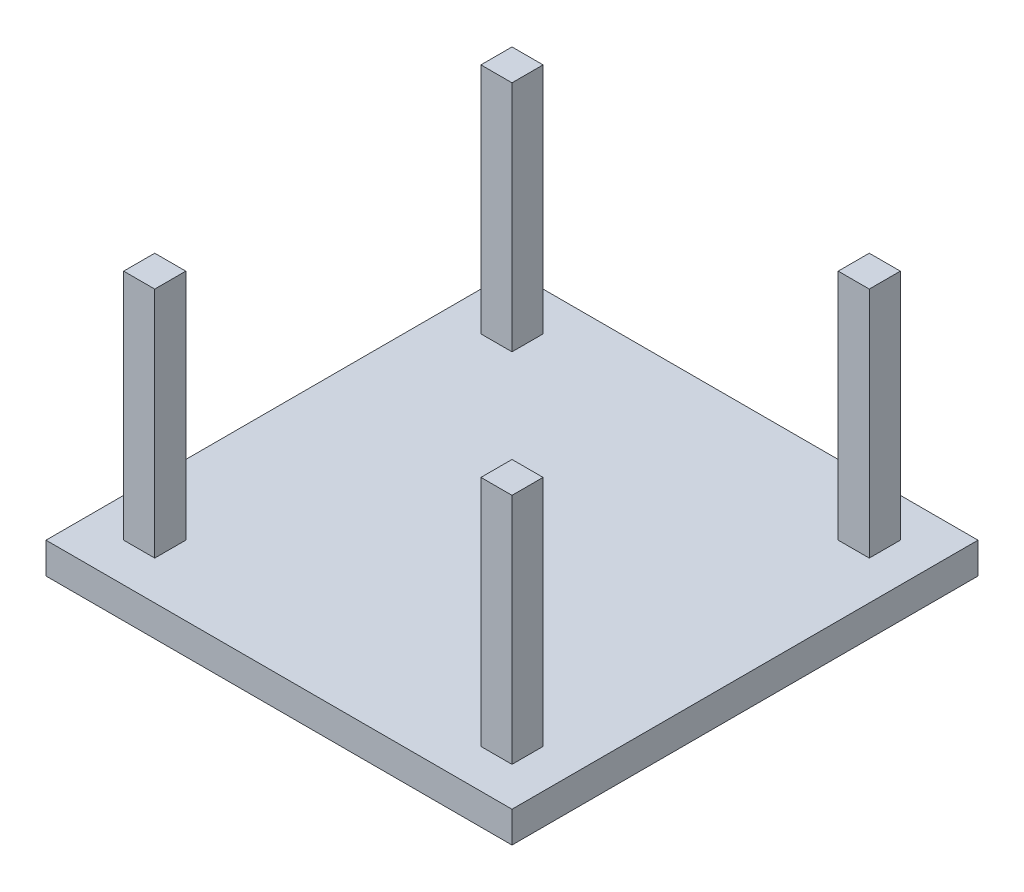
ISO-10303-21;
HEADER;
FILE_DESCRIPTION(('STEP AP214'),'2;1');
FILE_NAME('part.step','',(''),(''),'','','');
FILE_SCHEMA(('AUTOMOTIVE_DESIGN { 1 0 10303 214 1 1 1 1 }'));
ENDSEC;
DATA;
#1=APPLICATION_CONTEXT('core data for automotive mechanical design processes');
#2=APPLICATION_PROTOCOL_DEFINITION('international standard','automotive_design',2000,#1);
#3=PRODUCT_CONTEXT('',#1,'mechanical');
#4=PRODUCT('Part','Part','',(#3));
#5=PRODUCT_RELATED_PRODUCT_CATEGORY('part','',(#4));
#6=PRODUCT_DEFINITION_FORMATION('','',#4);
#7=PRODUCT_DEFINITION_CONTEXT('part definition',#1,'design');
#8=PRODUCT_DEFINITION('design','',#6,#7);
#9=PRODUCT_DEFINITION_SHAPE('','',#8);
#10=(LENGTH_UNIT() NAMED_UNIT(*) SI_UNIT(.MILLI.,.METRE.));
#11=(NAMED_UNIT(*) PLANE_ANGLE_UNIT() SI_UNIT($,.RADIAN.));
#12=(NAMED_UNIT(*) SI_UNIT($,.STERADIAN.) SOLID_ANGLE_UNIT());
#13=UNCERTAINTY_MEASURE_WITH_UNIT(LENGTH_MEASURE(1.E-05),#10,'distance_accuracy_value','');
#14=(GEOMETRIC_REPRESENTATION_CONTEXT(3) GLOBAL_UNCERTAINTY_ASSIGNED_CONTEXT((#13)) GLOBAL_UNIT_ASSIGNED_CONTEXT((#10,
#11,#12)) REPRESENTATION_CONTEXT('',''));
#15=CARTESIAN_POINT('',(0.,0.,0.));
#16=DIRECTION('',(0.,0.,1.));
#17=DIRECTION('',(1.,0.,0.));
#18=AXIS2_PLACEMENT_3D('',#15,#16,#17);
#19=CARTESIAN_POINT('',(0.,2.,0.));
#20=DIRECTION('',(0.,1.,0.));
#21=DIRECTION('',(0.,0.,1.));
#22=AXIS2_PLACEMENT_3D('',#19,#20,#21);
#23=PLANE('',#22);
#24=DIRECTION('',(0.,0.,1.));
#25=VECTOR('',#24,1.);
#26=CARTESIAN_POINT('',(-30.,2.,-30.));
#27=LINE('',#26,#25);
#28=CARTESIAN_POINT('',(-30.,2.,-30.));
#29=VERTEX_POINT('',#28);
#30=CARTESIAN_POINT('',(-30.,2.,0.));
#31=VERTEX_POINT('',#30);
#32=EDGE_CURVE('E333',#29,#31,#27,.T.);
#33=ORIENTED_EDGE('',*,*,#32,.T.);
#34=DIRECTION('',(1.,0.,0.));
#35=VECTOR('',#34,1.);
#36=CARTESIAN_POINT('',(-30.,2.,0.));
#37=LINE('',#36,#35);
#38=CARTESIAN_POINT('',(0.,2.,0.));
#39=VERTEX_POINT('',#38);
#40=EDGE_CURVE('E337',#31,#39,#37,.T.);
#41=ORIENTED_EDGE('',*,*,#40,.T.);
#42=DIRECTION('',(0.,0.,-1.));
#43=VECTOR('',#42,1.);
#44=CARTESIAN_POINT('',(0.,2.,-30.));
#45=LINE('',#44,#43);
#46=CARTESIAN_POINT('',(0.,2.,-30.));
#47=VERTEX_POINT('',#46);
#48=EDGE_CURVE('E341',#39,#47,#45,.T.);
#49=ORIENTED_EDGE('',*,*,#48,.T.);
#50=DIRECTION('',(-1.,0.,0.));
#51=VECTOR('',#50,1.);
#52=CARTESIAN_POINT('',(-30.,2.,-30.));
#53=LINE('',#52,#51);
#54=EDGE_CURVE('E344',#47,#29,#53,.T.);
#55=ORIENTED_EDGE('',*,*,#54,.T.);
#56=EDGE_LOOP('',(#33,#41,#49,#55));
#57=FACE_BOUND('',#56,.T.);
#58=DIRECTION('',(1.,0.,0.));
#59=VECTOR('',#58,1.);
#60=CARTESIAN_POINT('',(-27.5,2.,-25.5));
#61=LINE('',#60,#59);
#62=CARTESIAN_POINT('',(-27.5,2.,-25.5));
#63=VERTEX_POINT('',#62);
#64=CARTESIAN_POINT('',(-25.5,2.,-25.5));
#65=VERTEX_POINT('',#64);
#66=EDGE_CURVE('E310',#63,#65,#61,.T.);
#67=ORIENTED_EDGE('',*,*,#66,.F.);
#68=DIRECTION('',(0.,0.,1.));
#69=VECTOR('',#68,1.);
#70=CARTESIAN_POINT('',(-27.5,2.,-27.5));
#71=LINE('',#70,#69);
#72=CARTESIAN_POINT('',(-27.5,2.,-27.5));
#73=VERTEX_POINT('',#72);
#74=EDGE_CURVE('E291',#73,#63,#71,.T.);
#75=ORIENTED_EDGE('',*,*,#74,.F.);
#76=DIRECTION('',(-1.,0.,0.));
#77=VECTOR('',#76,1.);
#78=CARTESIAN_POINT('',(-27.5,2.,-27.5));
#79=LINE('',#78,#77);
#80=CARTESIAN_POINT('',(-25.5,2.,-27.5));
#81=VERTEX_POINT('',#80);
#82=EDGE_CURVE('E297',#81,#73,#79,.T.);
#83=ORIENTED_EDGE('',*,*,#82,.F.);
#84=DIRECTION('',(0.,0.,-1.));
#85=VECTOR('',#84,1.);
#86=CARTESIAN_POINT('',(-25.5,2.,-27.5));
#87=LINE('',#86,#85);
#88=EDGE_CURVE('E313',#65,#81,#87,.T.);
#89=ORIENTED_EDGE('',*,*,#88,.F.);
#90=EDGE_LOOP('',(#67,#75,#83,#89));
#91=FACE_BOUND('',#90,.T.);
#92=DIRECTION('',(1.,0.,0.));
#93=VECTOR('',#92,1.);
#94=CARTESIAN_POINT('',(-4.49999999999999,2.,-25.5));
#95=LINE('',#94,#93);
#96=CARTESIAN_POINT('',(-4.49999999999999,2.,-25.5));
#97=VERTEX_POINT('',#96);
#98=CARTESIAN_POINT('',(-2.49999999999999,2.,-25.5));
#99=VERTEX_POINT('',#98);
#100=EDGE_CURVE('E269',#97,#99,#95,.T.);
#101=ORIENTED_EDGE('',*,*,#100,.F.);
#102=DIRECTION('',(0.,0.,1.));
#103=VECTOR('',#102,1.);
#104=CARTESIAN_POINT('',(-4.49999999999999,2.,-27.5));
#105=LINE('',#104,#103);
#106=CARTESIAN_POINT('',(-4.49999999999999,2.,-27.5));
#107=VERTEX_POINT('',#106);
#108=EDGE_CURVE('E250',#107,#97,#105,.T.);
#109=ORIENTED_EDGE('',*,*,#108,.F.);
#110=DIRECTION('',(-1.,0.,0.));
#111=VECTOR('',#110,1.);
#112=CARTESIAN_POINT('',(-4.49999999999999,2.,-27.5));
#113=LINE('',#112,#111);
#114=CARTESIAN_POINT('',(-2.49999999999999,2.,-27.5));
#115=VERTEX_POINT('',#114);
#116=EDGE_CURVE('E256',#115,#107,#113,.T.);
#117=ORIENTED_EDGE('',*,*,#116,.F.);
#118=DIRECTION('',(0.,0.,-1.));
#119=VECTOR('',#118,1.);
#120=CARTESIAN_POINT('',(-2.49999999999999,2.,-27.5));
#121=LINE('',#120,#119);
#122=EDGE_CURVE('E272',#99,#115,#121,.T.);
#123=ORIENTED_EDGE('',*,*,#122,.F.);
#124=EDGE_LOOP('',(#101,#109,#117,#123));
#125=FACE_BOUND('',#124,.T.);
#126=DIRECTION('',(1.,0.,0.));
#127=VECTOR('',#126,1.);
#128=CARTESIAN_POINT('',(-4.49999999999999,2.,-2.5));
#129=LINE('',#128,#127);
#130=CARTESIAN_POINT('',(-4.49999999999999,2.,-2.5));
#131=VERTEX_POINT('',#130);
#132=CARTESIAN_POINT('',(-2.49999999999998,2.,-2.5));
#133=VERTEX_POINT('',#132);
#134=EDGE_CURVE('E211',#131,#133,#129,.T.);
#135=ORIENTED_EDGE('',*,*,#134,.F.);
#136=DIRECTION('',(0.,0.,1.));
#137=VECTOR('',#136,1.);
#138=CARTESIAN_POINT('',(-4.49999999999999,2.,-4.5));
#139=LINE('',#138,#137);
#140=CARTESIAN_POINT('',(-4.49999999999999,2.,-4.5));
#141=VERTEX_POINT('',#140);
#142=EDGE_CURVE('E206',#141,#131,#139,.T.);
#143=ORIENTED_EDGE('',*,*,#142,.F.);
#144=DIRECTION('',(-1.,0.,0.));
#145=VECTOR('',#144,1.);
#146=CARTESIAN_POINT('',(-4.49999999999999,2.,-4.5));
#147=LINE('',#146,#145);
#148=CARTESIAN_POINT('',(-2.49999999999999,2.,-4.5));
#149=VERTEX_POINT('',#148);
#150=EDGE_CURVE('E221',#149,#141,#147,.T.);
#151=ORIENTED_EDGE('',*,*,#150,.F.);
#152=DIRECTION('',(0.,0.,-1.));
#153=VECTOR('',#152,1.);
#154=CARTESIAN_POINT('',(-2.49999999999999,2.,-4.5));
#155=LINE('',#154,#153);
#156=EDGE_CURVE('E233',#133,#149,#155,.T.);
#157=ORIENTED_EDGE('',*,*,#156,.F.);
#158=EDGE_LOOP('',(#135,#143,#151,#157));
#159=FACE_BOUND('',#158,.T.);
#160=DIRECTION('',(1.,0.,0.));
#161=VECTOR('',#160,1.);
#162=CARTESIAN_POINT('',(-27.5,2.,-2.5));
#163=LINE('',#162,#161);
#164=CARTESIAN_POINT('',(-27.5,2.,-2.5));
#165=VERTEX_POINT('',#164);
#166=CARTESIAN_POINT('',(-25.5,2.,-2.5));
#167=VERTEX_POINT('',#166);
#168=EDGE_CURVE('E635',#165,#167,#163,.T.);
#169=ORIENTED_EDGE('',*,*,#168,.F.);
#170=DIRECTION('',(0.,0.,1.));
#171=VECTOR('',#170,1.);
#172=CARTESIAN_POINT('',(-27.5,2.,-4.5));
#173=LINE('',#172,#171);
#174=CARTESIAN_POINT('',(-27.5,2.,-4.5));
#175=VERTEX_POINT('',#174);
#176=EDGE_CURVE('E203',#175,#165,#173,.T.);
#177=ORIENTED_EDGE('',*,*,#176,.F.);
#178=DIRECTION('',(-1.,0.,0.));
#179=VECTOR('',#178,1.);
#180=CARTESIAN_POINT('',(-27.5,2.,-4.5));
#181=LINE('',#180,#179);
#182=CARTESIAN_POINT('',(-25.5,2.,-4.5));
#183=VERTEX_POINT('',#182);
#184=EDGE_CURVE('E199',#183,#175,#181,.T.);
#185=ORIENTED_EDGE('',*,*,#184,.F.);
#186=DIRECTION('',(0.,0.,-1.));
#187=VECTOR('',#186,1.);
#188=CARTESIAN_POINT('',(-25.5,2.,-4.5));
#189=LINE('',#188,#187);
#190=EDGE_CURVE('E631',#167,#183,#189,.T.);
#191=ORIENTED_EDGE('',*,*,#190,.F.);
#192=EDGE_LOOP('',(#169,#177,#185,#191));
#193=FACE_BOUND('',#192,.T.);
#194=ADVANCED_FACE('F39',(#57,#91,#125,#159,#193),#23,.T.);
#195=CARTESIAN_POINT('',(-30.,2.,-30.));
#196=DIRECTION('',(1.,0.,0.));
#197=DIRECTION('',(0.,0.,-1.));
#198=AXIS2_PLACEMENT_3D('',#195,#196,#197);
#199=PLANE('',#198);
#200=DIRECTION('',(0.,0.,1.));
#201=VECTOR('',#200,1.);
#202=CARTESIAN_POINT('',(-30.,0.,-30.));
#203=LINE('',#202,#201);
#204=CARTESIAN_POINT('',(-30.,0.,-30.));
#205=VERTEX_POINT('',#204);
#206=CARTESIAN_POINT('',(-30.,0.,0.));
#207=VERTEX_POINT('',#206);
#208=EDGE_CURVE('E332',#205,#207,#203,.T.);
#209=ORIENTED_EDGE('',*,*,#208,.T.);
#210=DIRECTION('',(0.,-1.,0.));
#211=VECTOR('',#210,1.);
#212=CARTESIAN_POINT('',(-30.,2.,0.));
#213=LINE('',#212,#211);
#214=EDGE_CURVE('E11',#31,#207,#213,.T.);
#215=ORIENTED_EDGE('',*,*,#214,.F.);
#216=ORIENTED_EDGE('',*,*,#32,.F.);
#217=DIRECTION('',(0.,-1.,0.));
#218=VECTOR('',#217,1.);
#219=CARTESIAN_POINT('',(-30.,2.,-30.));
#220=LINE('',#219,#218);
#221=EDGE_CURVE('E347',#29,#205,#220,.T.);
#222=ORIENTED_EDGE('',*,*,#221,.T.);
#223=EDGE_LOOP('',(#209,#215,#216,#222));
#224=FACE_BOUND('',#223,.T.);
#225=ADVANCED_FACE('F41',(#224),#199,.F.);
#226=CARTESIAN_POINT('',(-30.,2.,0.));
#227=DIRECTION('',(0.,0.,-1.));
#228=DIRECTION('',(-1.,0.,0.));
#229=AXIS2_PLACEMENT_3D('',#226,#227,#228);
#230=PLANE('',#229);
#231=DIRECTION('',(1.,0.,0.));
#232=VECTOR('',#231,1.);
#233=CARTESIAN_POINT('',(-30.,0.,0.));
#234=LINE('',#233,#232);
#235=CARTESIAN_POINT('',(0.,0.,0.));
#236=VERTEX_POINT('',#235);
#237=EDGE_CURVE('E351',#207,#236,#234,.T.);
#238=ORIENTED_EDGE('',*,*,#237,.T.);
#239=DIRECTION('',(0.,-1.,0.));
#240=VECTOR('',#239,1.);
#241=CARTESIAN_POINT('',(0.,2.,0.));
#242=LINE('',#241,#240);
#243=EDGE_CURVE('E48',#39,#236,#242,.T.);
#244=ORIENTED_EDGE('',*,*,#243,.F.);
#245=ORIENTED_EDGE('',*,*,#40,.F.);
#246=ORIENTED_EDGE('',*,*,#214,.T.);
#247=EDGE_LOOP('',(#238,#244,#245,#246));
#248=FACE_BOUND('',#247,.T.);
#249=ADVANCED_FACE('F387',(#248),#230,.F.);
#250=CARTESIAN_POINT('',(0.,2.,-30.));
#251=DIRECTION('',(-1.,0.,0.));
#252=DIRECTION('',(0.,0.,1.));
#253=AXIS2_PLACEMENT_3D('',#250,#251,#252);
#254=PLANE('',#253);
#255=DIRECTION('',(0.,0.,-1.));
#256=VECTOR('',#255,1.);
#257=CARTESIAN_POINT('',(0.,0.,-30.));
#258=LINE('',#257,#256);
#259=CARTESIAN_POINT('',(0.,0.,-30.));
#260=VERTEX_POINT('',#259);
#261=EDGE_CURVE('E354',#236,#260,#258,.T.);
#262=ORIENTED_EDGE('',*,*,#261,.T.);
#263=DIRECTION('',(0.,-1.,0.));
#264=VECTOR('',#263,1.);
#265=CARTESIAN_POINT('',(0.,2.,-30.));
#266=LINE('',#265,#264);
#267=EDGE_CURVE('E362',#47,#260,#266,.T.);
#268=ORIENTED_EDGE('',*,*,#267,.F.);
#269=ORIENTED_EDGE('',*,*,#48,.F.);
#270=ORIENTED_EDGE('',*,*,#243,.T.);
#271=EDGE_LOOP('',(#262,#268,#269,#270));
#272=FACE_BOUND('',#271,.T.);
#273=ADVANCED_FACE('F371',(#272),#254,.F.);
#274=CARTESIAN_POINT('',(-30.,2.,-30.));
#275=DIRECTION('',(0.,0.,1.));
#276=DIRECTION('',(1.,0.,0.));
#277=AXIS2_PLACEMENT_3D('',#274,#275,#276);
#278=PLANE('',#277);
#279=DIRECTION('',(-1.,0.,0.));
#280=VECTOR('',#279,1.);
#281=CARTESIAN_POINT('',(-30.,0.,-30.));
#282=LINE('',#281,#280);
#283=EDGE_CURVE('E338',#260,#205,#282,.T.);
#284=ORIENTED_EDGE('',*,*,#283,.T.);
#285=ORIENTED_EDGE('',*,*,#221,.F.);
#286=ORIENTED_EDGE('',*,*,#54,.F.);
#287=ORIENTED_EDGE('',*,*,#267,.T.);
#288=EDGE_LOOP('',(#284,#285,#286,#287));
#289=FACE_BOUND('',#288,.T.);
#290=ADVANCED_FACE('F380',(#289),#278,.F.);
#291=CARTESIAN_POINT('',(0.,0.,0.));
#292=DIRECTION('',(0.,1.,0.));
#293=DIRECTION('',(0.,0.,1.));
#294=AXIS2_PLACEMENT_3D('',#291,#292,#293);
#295=PLANE('',#294);
#296=ORIENTED_EDGE('',*,*,#208,.F.);
#297=ORIENTED_EDGE('',*,*,#283,.F.);
#298=ORIENTED_EDGE('',*,*,#261,.F.);
#299=ORIENTED_EDGE('',*,*,#237,.F.);
#300=EDGE_LOOP('',(#296,#297,#298,#299));
#301=FACE_BOUND('',#300,.T.);
#302=ADVANCED_FACE('F377',(#301),#295,.F.);
#303=CARTESIAN_POINT('',(-27.5,17.,-27.5));
#304=DIRECTION('',(1.,0.,0.));
#305=DIRECTION('',(0.,0.,-1.));
#306=AXIS2_PLACEMENT_3D('',#303,#304,#305);
#307=PLANE('',#306);
#308=ORIENTED_EDGE('',*,*,#74,.T.);
#309=DIRECTION('',(0.,-1.,0.));
#310=VECTOR('',#309,1.);
#311=CARTESIAN_POINT('',(-27.5,17.,-25.5));
#312=LINE('',#311,#310);
#313=CARTESIAN_POINT('',(-27.5,17.,-25.5));
#314=VERTEX_POINT('',#313);
#315=EDGE_CURVE('E329',#314,#63,#312,.T.);
#316=ORIENTED_EDGE('',*,*,#315,.F.);
#317=DIRECTION('',(0.,0.,1.));
#318=VECTOR('',#317,1.);
#319=CARTESIAN_POINT('',(-27.5,17.,-27.5));
#320=LINE('',#319,#318);
#321=CARTESIAN_POINT('',(-27.5,17.,-27.5));
#322=VERTEX_POINT('',#321);
#323=EDGE_CURVE('E292',#322,#314,#320,.T.);
#324=ORIENTED_EDGE('',*,*,#323,.F.);
#325=DIRECTION('',(0.,-1.,0.));
#326=VECTOR('',#325,1.);
#327=CARTESIAN_POINT('',(-27.5,17.,-27.5));
#328=LINE('',#327,#326);
#329=EDGE_CURVE('E306',#322,#73,#328,.T.);
#330=ORIENTED_EDGE('',*,*,#329,.T.);
#331=EDGE_LOOP('',(#308,#316,#324,#330));
#332=FACE_BOUND('',#331,.T.);
#333=ADVANCED_FACE('F400',(#332),#307,.F.);
#334=CARTESIAN_POINT('',(-27.5,17.,-25.5));
#335=DIRECTION('',(0.,0.,-1.));
#336=DIRECTION('',(-1.,0.,0.));
#337=AXIS2_PLACEMENT_3D('',#334,#335,#336);
#338=PLANE('',#337);
#339=ORIENTED_EDGE('',*,*,#66,.T.);
#340=DIRECTION('',(0.,-1.,0.));
#341=VECTOR('',#340,1.);
#342=CARTESIAN_POINT('',(-25.5,17.,-25.5));
#343=LINE('',#342,#341);
#344=CARTESIAN_POINT('',(-25.5,17.,-25.5));
#345=VERTEX_POINT('',#344);
#346=EDGE_CURVE('E325',#345,#65,#343,.T.);
#347=ORIENTED_EDGE('',*,*,#346,.F.);
#348=DIRECTION('',(1.,0.,0.));
#349=VECTOR('',#348,1.);
#350=CARTESIAN_POINT('',(-27.5,17.,-25.5));
#351=LINE('',#350,#349);
#352=EDGE_CURVE('E296',#314,#345,#351,.T.);
#353=ORIENTED_EDGE('',*,*,#352,.F.);
#354=ORIENTED_EDGE('',*,*,#315,.T.);
#355=EDGE_LOOP('',(#339,#347,#353,#354));
#356=FACE_BOUND('',#355,.T.);
#357=ADVANCED_FACE('F419',(#356),#338,.F.);
#358=CARTESIAN_POINT('',(-25.5,17.,-27.5));
#359=DIRECTION('',(-1.,0.,0.));
#360=DIRECTION('',(0.,0.,1.));
#361=AXIS2_PLACEMENT_3D('',#358,#359,#360);
#362=PLANE('',#361);
#363=ORIENTED_EDGE('',*,*,#88,.T.);
#364=DIRECTION('',(0.,-1.,0.));
#365=VECTOR('',#364,1.);
#366=CARTESIAN_POINT('',(-25.5,17.,-27.5));
#367=LINE('',#366,#365);
#368=CARTESIAN_POINT('',(-25.5,17.,-27.5));
#369=VERTEX_POINT('',#368);
#370=EDGE_CURVE('E322',#369,#81,#367,.T.);
#371=ORIENTED_EDGE('',*,*,#370,.F.);
#372=DIRECTION('',(0.,0.,-1.));
#373=VECTOR('',#372,1.);
#374=CARTESIAN_POINT('',(-25.5,17.,-27.5));
#375=LINE('',#374,#373);
#376=EDGE_CURVE('E300',#345,#369,#375,.T.);
#377=ORIENTED_EDGE('',*,*,#376,.F.);
#378=ORIENTED_EDGE('',*,*,#346,.T.);
#379=EDGE_LOOP('',(#363,#371,#377,#378));
#380=FACE_BOUND('',#379,.T.);
#381=ADVANCED_FACE('F426',(#380),#362,.F.);
#382=CARTESIAN_POINT('',(-27.5,17.,-27.5));
#383=DIRECTION('',(0.,0.,1.));
#384=DIRECTION('',(1.,0.,0.));
#385=AXIS2_PLACEMENT_3D('',#382,#383,#384);
#386=PLANE('',#385);
#387=ORIENTED_EDGE('',*,*,#82,.T.);
#388=ORIENTED_EDGE('',*,*,#329,.F.);
#389=DIRECTION('',(-1.,0.,0.));
#390=VECTOR('',#389,1.);
#391=CARTESIAN_POINT('',(-27.5,17.,-27.5));
#392=LINE('',#391,#390);
#393=EDGE_CURVE('E303',#369,#322,#392,.T.);
#394=ORIENTED_EDGE('',*,*,#393,.F.);
#395=ORIENTED_EDGE('',*,*,#370,.T.);
#396=EDGE_LOOP('',(#387,#388,#394,#395));
#397=FACE_BOUND('',#396,.T.);
#398=ADVANCED_FACE('F433',(#397),#386,.F.);
#399=CARTESIAN_POINT('',(0.,17.,0.));
#400=DIRECTION('',(0.,1.,0.));
#401=DIRECTION('',(0.,0.,1.));
#402=AXIS2_PLACEMENT_3D('',#399,#400,#401);
#403=PLANE('',#402);
#404=ORIENTED_EDGE('',*,*,#323,.T.);
#405=ORIENTED_EDGE('',*,*,#352,.T.);
#406=ORIENTED_EDGE('',*,*,#376,.T.);
#407=ORIENTED_EDGE('',*,*,#393,.T.);
#408=EDGE_LOOP('',(#404,#405,#406,#407));
#409=FACE_BOUND('',#408,.T.);
#410=ADVANCED_FACE('F441',(#409),#403,.T.);
#411=CARTESIAN_POINT('',(-4.49999999999999,17.,-27.5));
#412=DIRECTION('',(1.,0.,0.));
#413=DIRECTION('',(0.,0.,-1.));
#414=AXIS2_PLACEMENT_3D('',#411,#412,#413);
#415=PLANE('',#414);
#416=ORIENTED_EDGE('',*,*,#108,.T.);
#417=DIRECTION('',(0.,-1.,0.));
#418=VECTOR('',#417,1.);
#419=CARTESIAN_POINT('',(-4.49999999999999,17.,-25.5));
#420=LINE('',#419,#418);
#421=CARTESIAN_POINT('',(-4.49999999999999,17.,-25.5));
#422=VERTEX_POINT('',#421);
#423=EDGE_CURVE('E288',#422,#97,#420,.T.);
#424=ORIENTED_EDGE('',*,*,#423,.F.);
#425=DIRECTION('',(0.,0.,1.));
#426=VECTOR('',#425,1.);
#427=CARTESIAN_POINT('',(-4.49999999999999,17.,-27.5));
#428=LINE('',#427,#426);
#429=CARTESIAN_POINT('',(-4.49999999999999,17.,-27.5));
#430=VERTEX_POINT('',#429);
#431=EDGE_CURVE('E251',#430,#422,#428,.T.);
#432=ORIENTED_EDGE('',*,*,#431,.F.);
#433=DIRECTION('',(0.,-1.,0.));
#434=VECTOR('',#433,1.);
#435=CARTESIAN_POINT('',(-4.49999999999999,17.,-27.5));
#436=LINE('',#435,#434);
#437=EDGE_CURVE('E265',#430,#107,#436,.T.);
#438=ORIENTED_EDGE('',*,*,#437,.T.);
#439=EDGE_LOOP('',(#416,#424,#432,#438));
#440=FACE_BOUND('',#439,.T.);
#441=ADVANCED_FACE('F449',(#440),#415,.F.);
#442=CARTESIAN_POINT('',(-4.49999999999999,17.,-25.5));
#443=DIRECTION('',(0.,0.,-1.));
#444=DIRECTION('',(-1.,0.,0.));
#445=AXIS2_PLACEMENT_3D('',#442,#443,#444);
#446=PLANE('',#445);
#447=ORIENTED_EDGE('',*,*,#100,.T.);
#448=DIRECTION('',(0.,-1.,0.));
#449=VECTOR('',#448,1.);
#450=CARTESIAN_POINT('',(-2.49999999999999,17.,-25.5));
#451=LINE('',#450,#449);
#452=CARTESIAN_POINT('',(-2.49999999999999,17.,-25.5));
#453=VERTEX_POINT('',#452);
#454=EDGE_CURVE('E284',#453,#99,#451,.T.);
#455=ORIENTED_EDGE('',*,*,#454,.F.);
#456=DIRECTION('',(1.,0.,0.));
#457=VECTOR('',#456,1.);
#458=CARTESIAN_POINT('',(-4.49999999999999,17.,-25.5));
#459=LINE('',#458,#457);
#460=EDGE_CURVE('E255',#422,#453,#459,.T.);
#461=ORIENTED_EDGE('',*,*,#460,.F.);
#462=ORIENTED_EDGE('',*,*,#423,.T.);
#463=EDGE_LOOP('',(#447,#455,#461,#462));
#464=FACE_BOUND('',#463,.T.);
#465=ADVANCED_FACE('F457',(#464),#446,.F.);
#466=CARTESIAN_POINT('',(-2.49999999999999,17.,-27.5));
#467=DIRECTION('',(-1.,0.,0.));
#468=DIRECTION('',(0.,0.,1.));
#469=AXIS2_PLACEMENT_3D('',#466,#467,#468);
#470=PLANE('',#469);
#471=ORIENTED_EDGE('',*,*,#122,.T.);
#472=DIRECTION('',(0.,-1.,0.));
#473=VECTOR('',#472,1.);
#474=CARTESIAN_POINT('',(-2.49999999999999,17.,-27.5));
#475=LINE('',#474,#473);
#476=CARTESIAN_POINT('',(-2.49999999999999,17.,-27.5));
#477=VERTEX_POINT('',#476);
#478=EDGE_CURVE('E281',#477,#115,#475,.T.);
#479=ORIENTED_EDGE('',*,*,#478,.F.);
#480=DIRECTION('',(0.,0.,-1.));
#481=VECTOR('',#480,1.);
#482=CARTESIAN_POINT('',(-2.49999999999999,17.,-27.5));
#483=LINE('',#482,#481);
#484=EDGE_CURVE('E259',#453,#477,#483,.T.);
#485=ORIENTED_EDGE('',*,*,#484,.F.);
#486=ORIENTED_EDGE('',*,*,#454,.T.);
#487=EDGE_LOOP('',(#471,#479,#485,#486));
#488=FACE_BOUND('',#487,.T.);
#489=ADVANCED_FACE('F465',(#488),#470,.F.);
#490=CARTESIAN_POINT('',(-4.49999999999999,17.,-27.5));
#491=DIRECTION('',(0.,0.,1.));
#492=DIRECTION('',(1.,0.,0.));
#493=AXIS2_PLACEMENT_3D('',#490,#491,#492);
#494=PLANE('',#493);
#495=ORIENTED_EDGE('',*,*,#116,.T.);
#496=ORIENTED_EDGE('',*,*,#437,.F.);
#497=DIRECTION('',(-1.,0.,0.));
#498=VECTOR('',#497,1.);
#499=CARTESIAN_POINT('',(-4.49999999999999,17.,-27.5));
#500=LINE('',#499,#498);
#501=EDGE_CURVE('E262',#477,#430,#500,.T.);
#502=ORIENTED_EDGE('',*,*,#501,.F.);
#503=ORIENTED_EDGE('',*,*,#478,.T.);
#504=EDGE_LOOP('',(#495,#496,#502,#503));
#505=FACE_BOUND('',#504,.T.);
#506=ADVANCED_FACE('F473',(#505),#494,.F.);
#507=CARTESIAN_POINT('',(0.,17.,0.));
#508=DIRECTION('',(0.,1.,0.));
#509=DIRECTION('',(0.,0.,1.));
#510=AXIS2_PLACEMENT_3D('',#507,#508,#509);
#511=PLANE('',#510);
#512=ORIENTED_EDGE('',*,*,#431,.T.);
#513=ORIENTED_EDGE('',*,*,#460,.T.);
#514=ORIENTED_EDGE('',*,*,#484,.T.);
#515=ORIENTED_EDGE('',*,*,#501,.T.);
#516=EDGE_LOOP('',(#512,#513,#514,#515));
#517=FACE_BOUND('',#516,.T.);
#518=ADVANCED_FACE('F481',(#517),#511,.T.);
#519=CARTESIAN_POINT('',(-4.49999999999999,17.,-4.5));
#520=DIRECTION('',(1.,0.,0.));
#521=DIRECTION('',(0.,0.,-1.));
#522=AXIS2_PLACEMENT_3D('',#519,#520,#521);
#523=PLANE('',#522);
#524=ORIENTED_EDGE('',*,*,#142,.T.);
#525=DIRECTION('',(0.,-1.,0.));
#526=VECTOR('',#525,1.);
#527=CARTESIAN_POINT('',(-4.49999999999999,17.,-2.5));
#528=LINE('',#527,#526);
#529=CARTESIAN_POINT('',(-4.49999999999999,17.,-2.5));
#530=VERTEX_POINT('',#529);
#531=EDGE_CURVE('E247',#530,#131,#528,.T.);
#532=ORIENTED_EDGE('',*,*,#531,.F.);
#533=DIRECTION('',(0.,0.,1.));
#534=VECTOR('',#533,1.);
#535=CARTESIAN_POINT('',(-4.49999999999999,17.,-4.5));
#536=LINE('',#535,#534);
#537=CARTESIAN_POINT('',(-4.49999999999999,17.,-4.5));
#538=VERTEX_POINT('',#537);
#539=EDGE_CURVE('E216',#538,#530,#536,.T.);
#540=ORIENTED_EDGE('',*,*,#539,.F.);
#541=DIRECTION('',(0.,-1.,0.));
#542=VECTOR('',#541,1.);
#543=CARTESIAN_POINT('',(-4.49999999999999,17.,-4.5));
#544=LINE('',#543,#542);
#545=EDGE_CURVE('E229',#538,#141,#544,.T.);
#546=ORIENTED_EDGE('',*,*,#545,.T.);
#547=EDGE_LOOP('',(#524,#532,#540,#546));
#548=FACE_BOUND('',#547,.T.);
#549=ADVANCED_FACE('F489',(#548),#523,.F.);
#550=CARTESIAN_POINT('',(-4.49999999999999,17.,-2.5));
#551=DIRECTION('',(0.,0.,-1.));
#552=DIRECTION('',(-1.,0.,0.));
#553=AXIS2_PLACEMENT_3D('',#550,#551,#552);
#554=PLANE('',#553);
#555=ORIENTED_EDGE('',*,*,#134,.T.);
#556=DIRECTION('',(0.,-1.,0.));
#557=VECTOR('',#556,1.);
#558=CARTESIAN_POINT('',(-2.49999999999998,17.,-2.5));
#559=LINE('',#558,#557);
#560=CARTESIAN_POINT('',(-2.49999999999998,17.,-2.5));
#561=VERTEX_POINT('',#560);
#562=EDGE_CURVE('E243',#561,#133,#559,.T.);
#563=ORIENTED_EDGE('',*,*,#562,.F.);
#564=DIRECTION('',(1.,0.,0.));
#565=VECTOR('',#564,1.);
#566=CARTESIAN_POINT('',(-4.49999999999999,17.,-2.5));
#567=LINE('',#566,#565);
#568=EDGE_CURVE('E220',#530,#561,#567,.T.);
#569=ORIENTED_EDGE('',*,*,#568,.F.);
#570=ORIENTED_EDGE('',*,*,#531,.T.);
#571=EDGE_LOOP('',(#555,#563,#569,#570));
#572=FACE_BOUND('',#571,.T.);
#573=ADVANCED_FACE('F497',(#572),#554,.F.);
#574=CARTESIAN_POINT('',(-2.49999999999999,17.,-4.5));
#575=DIRECTION('',(-1.,0.,0.));
#576=DIRECTION('',(0.,0.,1.));
#577=AXIS2_PLACEMENT_3D('',#574,#575,#576);
#578=PLANE('',#577);
#579=ORIENTED_EDGE('',*,*,#156,.T.);
#580=DIRECTION('',(0.,-1.,0.));
#581=VECTOR('',#580,1.);
#582=CARTESIAN_POINT('',(-2.49999999999999,17.,-4.5));
#583=LINE('',#582,#581);
#584=CARTESIAN_POINT('',(-2.49999999999999,17.,-4.5));
#585=VERTEX_POINT('',#584);
#586=EDGE_CURVE('E63',#585,#149,#583,.T.);
#587=ORIENTED_EDGE('',*,*,#586,.F.);
#588=DIRECTION('',(0.,0.,-1.));
#589=VECTOR('',#588,1.);
#590=CARTESIAN_POINT('',(-2.49999999999999,17.,-4.5));
#591=LINE('',#590,#589);
#592=EDGE_CURVE('E224',#561,#585,#591,.T.);
#593=ORIENTED_EDGE('',*,*,#592,.F.);
#594=ORIENTED_EDGE('',*,*,#562,.T.);
#595=EDGE_LOOP('',(#579,#587,#593,#594));
#596=FACE_BOUND('',#595,.T.);
#597=ADVANCED_FACE('F505',(#596),#578,.F.);
#598=CARTESIAN_POINT('',(-4.49999999999999,17.,-4.5));
#599=DIRECTION('',(0.,0.,1.));
#600=DIRECTION('',(1.,0.,0.));
#601=AXIS2_PLACEMENT_3D('',#598,#599,#600);
#602=PLANE('',#601);
#603=ORIENTED_EDGE('',*,*,#150,.T.);
#604=ORIENTED_EDGE('',*,*,#545,.F.);
#605=DIRECTION('',(-1.,0.,0.));
#606=VECTOR('',#605,1.);
#607=CARTESIAN_POINT('',(-4.49999999999999,17.,-4.5));
#608=LINE('',#607,#606);
#609=EDGE_CURVE('E227',#585,#538,#608,.T.);
#610=ORIENTED_EDGE('',*,*,#609,.F.);
#611=ORIENTED_EDGE('',*,*,#586,.T.);
#612=EDGE_LOOP('',(#603,#604,#610,#611));
#613=FACE_BOUND('',#612,.T.);
#614=ADVANCED_FACE('F513',(#613),#602,.F.);
#615=CARTESIAN_POINT('',(0.,17.,0.));
#616=DIRECTION('',(0.,1.,0.));
#617=DIRECTION('',(0.,0.,1.));
#618=AXIS2_PLACEMENT_3D('',#615,#616,#617);
#619=PLANE('',#618);
#620=ORIENTED_EDGE('',*,*,#539,.T.);
#621=ORIENTED_EDGE('',*,*,#568,.T.);
#622=ORIENTED_EDGE('',*,*,#592,.T.);
#623=ORIENTED_EDGE('',*,*,#609,.T.);
#624=EDGE_LOOP('',(#620,#621,#622,#623));
#625=FACE_BOUND('',#624,.T.);
#626=ADVANCED_FACE('F521',(#625),#619,.T.);
#627=CARTESIAN_POINT('',(-27.5,17.,-4.5));
#628=DIRECTION('',(1.,0.,0.));
#629=DIRECTION('',(0.,0.,-1.));
#630=AXIS2_PLACEMENT_3D('',#627,#628,#629);
#631=PLANE('',#630);
#632=ORIENTED_EDGE('',*,*,#176,.T.);
#633=DIRECTION('',(0.,-1.,0.));
#634=VECTOR('',#633,1.);
#635=CARTESIAN_POINT('',(-27.5,17.,-2.5));
#636=LINE('',#635,#634);
#637=CARTESIAN_POINT('',(-27.5,17.,-2.5));
#638=VERTEX_POINT('',#637);
#639=EDGE_CURVE('E182',#638,#165,#636,.T.);
#640=ORIENTED_EDGE('',*,*,#639,.F.);
#641=DIRECTION('',(0.,0.,1.));
#642=VECTOR('',#641,1.);
#643=CARTESIAN_POINT('',(-27.5,17.,-4.5));
#644=LINE('',#643,#642);
#645=CARTESIAN_POINT('',(-27.5,17.,-4.5));
#646=VERTEX_POINT('',#645);
#647=EDGE_CURVE('E190',#646,#638,#644,.T.);
#648=ORIENTED_EDGE('',*,*,#647,.F.);
#649=DIRECTION('',(0.,-1.,0.));
#650=VECTOR('',#649,1.);
#651=CARTESIAN_POINT('',(-27.5,17.,-4.5));
#652=LINE('',#651,#650);
#653=EDGE_CURVE('E627',#646,#175,#652,.T.);
#654=ORIENTED_EDGE('',*,*,#653,.T.);
#655=EDGE_LOOP('',(#632,#640,#648,#654));
#656=FACE_BOUND('',#655,.T.);
#657=ADVANCED_FACE('F201',(#656),#631,.F.);
#658=CARTESIAN_POINT('',(-27.5,17.,-2.5));
#659=DIRECTION('',(0.,0.,-1.));
#660=DIRECTION('',(-1.,0.,0.));
#661=AXIS2_PLACEMENT_3D('',#658,#659,#660);
#662=PLANE('',#661);
#663=ORIENTED_EDGE('',*,*,#168,.T.);
#664=DIRECTION('',(0.,-1.,0.));
#665=VECTOR('',#664,1.);
#666=CARTESIAN_POINT('',(-25.5,17.,-2.5));
#667=LINE('',#666,#665);
#668=CARTESIAN_POINT('',(-25.5,17.,-2.5));
#669=VERTEX_POINT('',#668);
#670=EDGE_CURVE('E185',#669,#167,#667,.T.);
#671=ORIENTED_EDGE('',*,*,#670,.F.);
#672=DIRECTION('',(1.,0.,0.));
#673=VECTOR('',#672,1.);
#674=CARTESIAN_POINT('',(-27.5,17.,-2.5));
#675=LINE('',#674,#673);
#676=EDGE_CURVE('E178',#638,#669,#675,.T.);
#677=ORIENTED_EDGE('',*,*,#676,.F.);
#678=ORIENTED_EDGE('',*,*,#639,.T.);
#679=EDGE_LOOP('',(#663,#671,#677,#678));
#680=FACE_BOUND('',#679,.T.);
#681=ADVANCED_FACE('F180',(#680),#662,.F.);
#682=CARTESIAN_POINT('',(-25.5,17.,-4.5));
#683=DIRECTION('',(-1.,0.,0.));
#684=DIRECTION('',(0.,0.,1.));
#685=AXIS2_PLACEMENT_3D('',#682,#683,#684);
#686=PLANE('',#685);
#687=ORIENTED_EDGE('',*,*,#190,.T.);
#688=DIRECTION('',(0.,-1.,0.));
#689=VECTOR('',#688,1.);
#690=CARTESIAN_POINT('',(-25.5,17.,-4.5));
#691=LINE('',#690,#689);
#692=CARTESIAN_POINT('',(-25.5,17.,-4.5));
#693=VERTEX_POINT('',#692);
#694=EDGE_CURVE('E55',#693,#183,#691,.T.);
#695=ORIENTED_EDGE('',*,*,#694,.F.);
#696=DIRECTION('',(0.,0.,-1.));
#697=VECTOR('',#696,1.);
#698=CARTESIAN_POINT('',(-25.5,17.,-4.5));
#699=LINE('',#698,#697);
#700=EDGE_CURVE('E189',#669,#693,#699,.T.);
#701=ORIENTED_EDGE('',*,*,#700,.F.);
#702=ORIENTED_EDGE('',*,*,#670,.T.);
#703=EDGE_LOOP('',(#687,#695,#701,#702));
#704=FACE_BOUND('',#703,.T.);
#705=ADVANCED_FACE('F541',(#704),#686,.F.);
#706=CARTESIAN_POINT('',(-27.5,17.,-4.5));
#707=DIRECTION('',(0.,0.,1.));
#708=DIRECTION('',(1.,0.,0.));
#709=AXIS2_PLACEMENT_3D('',#706,#707,#708);
#710=PLANE('',#709);
#711=ORIENTED_EDGE('',*,*,#184,.T.);
#712=ORIENTED_EDGE('',*,*,#653,.F.);
#713=DIRECTION('',(-1.,0.,0.));
#714=VECTOR('',#713,1.);
#715=CARTESIAN_POINT('',(-27.5,17.,-4.5));
#716=LINE('',#715,#714);
#717=EDGE_CURVE('E194',#693,#646,#716,.T.);
#718=ORIENTED_EDGE('',*,*,#717,.F.);
#719=ORIENTED_EDGE('',*,*,#694,.T.);
#720=EDGE_LOOP('',(#711,#712,#718,#719));
#721=FACE_BOUND('',#720,.T.);
#722=ADVANCED_FACE('F548',(#721),#710,.F.);
#723=CARTESIAN_POINT('',(0.,17.,0.));
#724=DIRECTION('',(0.,1.,0.));
#725=DIRECTION('',(0.,0.,1.));
#726=AXIS2_PLACEMENT_3D('',#723,#724,#725);
#727=PLANE('',#726);
#728=ORIENTED_EDGE('',*,*,#647,.T.);
#729=ORIENTED_EDGE('',*,*,#676,.T.);
#730=ORIENTED_EDGE('',*,*,#700,.T.);
#731=ORIENTED_EDGE('',*,*,#717,.T.);
#732=EDGE_LOOP('',(#728,#729,#730,#731));
#733=FACE_BOUND('',#732,.T.);
#734=ADVANCED_FACE('F193',(#733),#727,.T.);
#735=CLOSED_SHELL('',(#194,#225,#249,#273,#290,#302,#333,#357,#381,#398,#410,#441,#465,#489,
#506,#518,#549,#573,#597,#614,#626,#657,#681,#705,#722,#734));
#736=MANIFOLD_SOLID_BREP('B2',#735);
#737=ADVANCED_BREP_SHAPE_REPRESENTATION('',(#18,#736),#14);
#738=SHAPE_DEFINITION_REPRESENTATION(#9,#737);
ENDSEC;
END-ISO-10303-21;
